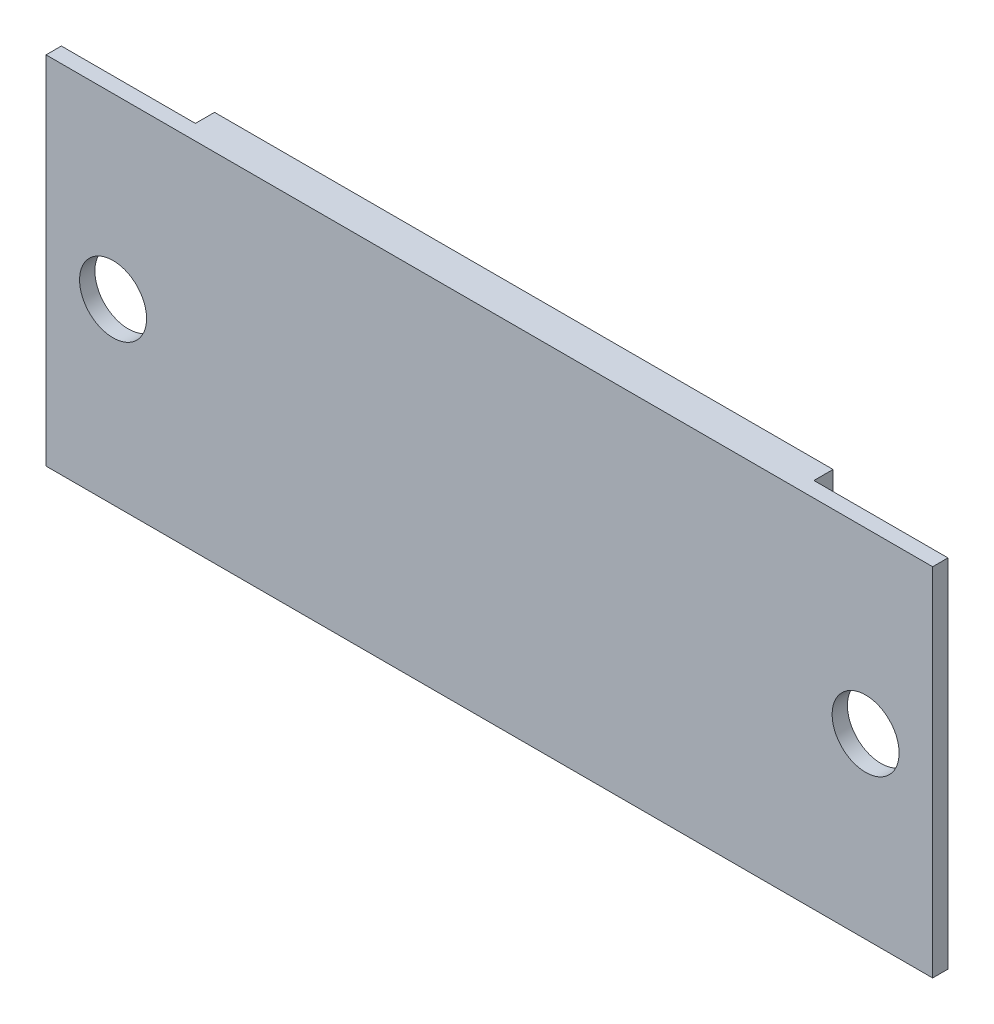
ISO-10303-21;
HEADER;
FILE_DESCRIPTION(('STEP AP214'),'2;1');
FILE_NAME('part.step','',(''),(''),'','','');
FILE_SCHEMA(('AUTOMOTIVE_DESIGN { 1 0 10303 214 1 1 1 1 }'));
ENDSEC;
DATA;
#1=APPLICATION_CONTEXT('core data for automotive mechanical design processes');
#2=APPLICATION_PROTOCOL_DEFINITION('international standard','automotive_design',2000,#1);
#3=PRODUCT_CONTEXT('',#1,'mechanical');
#4=PRODUCT('Part','Part','',(#3));
#5=PRODUCT_RELATED_PRODUCT_CATEGORY('part','',(#4));
#6=PRODUCT_DEFINITION_FORMATION('','',#4);
#7=PRODUCT_DEFINITION_CONTEXT('part definition',#1,'design');
#8=PRODUCT_DEFINITION('design','',#6,#7);
#9=PRODUCT_DEFINITION_SHAPE('','',#8);
#10=(LENGTH_UNIT() NAMED_UNIT(*) SI_UNIT(.MILLI.,.METRE.));
#11=(NAMED_UNIT(*) PLANE_ANGLE_UNIT() SI_UNIT($,.RADIAN.));
#12=(NAMED_UNIT(*) SI_UNIT($,.STERADIAN.) SOLID_ANGLE_UNIT());
#13=UNCERTAINTY_MEASURE_WITH_UNIT(LENGTH_MEASURE(1.E-05),#10,'distance_accuracy_value','');
#14=(GEOMETRIC_REPRESENTATION_CONTEXT(3) GLOBAL_UNCERTAINTY_ASSIGNED_CONTEXT((#13)) GLOBAL_UNIT_ASSIGNED_CONTEXT((#10,
#11,#12)) REPRESENTATION_CONTEXT('',''));
#15=CARTESIAN_POINT('',(0.,0.,0.));
#16=DIRECTION('',(0.,0.,1.));
#17=DIRECTION('',(1.,0.,0.));
#18=AXIS2_PLACEMENT_3D('',#15,#16,#17);
#19=CARTESIAN_POINT('',(16.15,-9.3,1.8));
#20=DIRECTION('',(-1.,0.,0.));
#21=DIRECTION('',(0.,0.,1.));
#22=AXIS2_PLACEMENT_3D('',#19,#20,#21);
#23=PLANE('',#22);
#24=DIRECTION('',(0.,0.,-1.));
#25=VECTOR('',#24,1.);
#26=CARTESIAN_POINT('',(16.15,9.3,1.8));
#27=LINE('',#26,#25);
#28=CARTESIAN_POINT('',(16.15,9.3,1.));
#29=VERTEX_POINT('',#28);
#30=CARTESIAN_POINT('',(16.15,9.3,0.));
#31=VERTEX_POINT('',#30);
#32=EDGE_CURVE('E12',#29,#31,#27,.T.);
#33=ORIENTED_EDGE('',*,*,#32,.F.);
#34=DIRECTION('',(0.,-1.,0.));
#35=VECTOR('',#34,1.);
#36=CARTESIAN_POINT('',(16.15,9.3,1.));
#37=LINE('',#36,#35);
#38=CARTESIAN_POINT('',(16.15,-9.3,1.));
#39=VERTEX_POINT('',#38);
#40=EDGE_CURVE('E99',#29,#39,#37,.T.);
#41=ORIENTED_EDGE('',*,*,#40,.T.);
#42=DIRECTION('',(0.,0.,-1.));
#43=VECTOR('',#42,1.);
#44=CARTESIAN_POINT('',(16.15,-9.3,1.8));
#45=LINE('',#44,#43);
#46=CARTESIAN_POINT('',(16.15,-9.3,0.));
#47=VERTEX_POINT('',#46);
#48=EDGE_CURVE('E120',#39,#47,#45,.T.);
#49=ORIENTED_EDGE('',*,*,#48,.T.);
#50=DIRECTION('',(0.,1.,0.));
#51=VECTOR('',#50,1.);
#52=CARTESIAN_POINT('',(16.15,-9.3,0.));
#53=LINE('',#52,#51);
#54=EDGE_CURVE('E119',#47,#31,#53,.T.);
#55=ORIENTED_EDGE('',*,*,#54,.T.);
#56=EDGE_LOOP('',(#33,#41,#49,#55));
#57=FACE_BOUND('',#56,.T.);
#58=ADVANCED_FACE('F39',(#57),#23,.F.);
#59=CARTESIAN_POINT('',(-16.15,9.3,1.8));
#60=DIRECTION('',(0.,-1.,0.));
#61=DIRECTION('',(0.,0.,-1.));
#62=AXIS2_PLACEMENT_3D('',#59,#60,#61);
#63=PLANE('',#62);
#64=DIRECTION('',(-1.,0.,0.));
#65=VECTOR('',#64,1.);
#66=CARTESIAN_POINT('',(-16.15,9.3,0.));
#67=LINE('',#66,#65);
#68=CARTESIAN_POINT('',(-16.15,9.3,0.));
#69=VERTEX_POINT('',#68);
#70=EDGE_CURVE('E124',#31,#69,#67,.T.);
#71=ORIENTED_EDGE('',*,*,#70,.T.);
#72=DIRECTION('',(0.,0.,-1.));
#73=VECTOR('',#72,1.);
#74=CARTESIAN_POINT('',(-16.15,9.3,1.8));
#75=LINE('',#74,#73);
#76=CARTESIAN_POINT('',(-16.15,9.3,1.));
#77=VERTEX_POINT('',#76);
#78=EDGE_CURVE('E46',#77,#69,#75,.T.);
#79=ORIENTED_EDGE('',*,*,#78,.F.);
#80=DIRECTION('',(-1.,0.,0.));
#81=VECTOR('',#80,1.);
#82=CARTESIAN_POINT('',(-16.15,9.3,1.));
#83=LINE('',#82,#81);
#84=CARTESIAN_POINT('',(-23.15,9.3,1.));
#85=VERTEX_POINT('',#84);
#86=EDGE_CURVE('E61',#77,#85,#83,.T.);
#87=ORIENTED_EDGE('',*,*,#86,.T.);
#88=DIRECTION('',(0.,0.,1.));
#89=VECTOR('',#88,1.);
#90=CARTESIAN_POINT('',(-23.15,9.3,-19.8736005796635));
#91=LINE('',#90,#89);
#92=CARTESIAN_POINT('',(-23.15,9.3,1.8));
#93=VERTEX_POINT('',#92);
#94=EDGE_CURVE('E125',#85,#93,#91,.T.);
#95=ORIENTED_EDGE('',*,*,#94,.T.);
#96=DIRECTION('',(-1.,0.,0.));
#97=VECTOR('',#96,1.);
#98=CARTESIAN_POINT('',(-16.15,9.3,1.8));
#99=LINE('',#98,#97);
#100=CARTESIAN_POINT('',(23.15,9.3,1.8));
#101=VERTEX_POINT('',#100);
#102=EDGE_CURVE('E139',#101,#93,#99,.T.);
#103=ORIENTED_EDGE('',*,*,#102,.F.);
#104=DIRECTION('',(0.,0.,1.));
#105=VECTOR('',#104,1.);
#106=CARTESIAN_POINT('',(23.15,9.3,-19.8736005796635));
#107=LINE('',#106,#105);
#108=CARTESIAN_POINT('',(23.15,9.3,1.));
#109=VERTEX_POINT('',#108);
#110=EDGE_CURVE('E114',#109,#101,#107,.T.);
#111=ORIENTED_EDGE('',*,*,#110,.F.);
#112=DIRECTION('',(-1.,0.,0.));
#113=VECTOR('',#112,1.);
#114=CARTESIAN_POINT('',(16.15,9.3,1.));
#115=LINE('',#114,#113);
#116=EDGE_CURVE('E102',#109,#29,#115,.T.);
#117=ORIENTED_EDGE('',*,*,#116,.T.);
#118=ORIENTED_EDGE('',*,*,#32,.T.);
#119=EDGE_LOOP('',(#71,#79,#87,#95,#103,#111,#117,#118));
#120=FACE_BOUND('',#119,.T.);
#121=ADVANCED_FACE('F111',(#120),#63,.F.);
#122=CARTESIAN_POINT('',(-16.15,-9.3,1.8));
#123=DIRECTION('',(1.,0.,0.));
#124=DIRECTION('',(0.,0.,-1.));
#125=AXIS2_PLACEMENT_3D('',#122,#123,#124);
#126=PLANE('',#125);
#127=DIRECTION('',(0.,0.,-1.));
#128=VECTOR('',#127,1.);
#129=CARTESIAN_POINT('',(-16.15,-9.3,1.8));
#130=LINE('',#129,#128);
#131=CARTESIAN_POINT('',(-16.15,-9.3,1.));
#132=VERTEX_POINT('',#131);
#133=CARTESIAN_POINT('',(-16.15,-9.3,0.));
#134=VERTEX_POINT('',#133);
#135=EDGE_CURVE('E141',#132,#134,#130,.T.);
#136=ORIENTED_EDGE('',*,*,#135,.F.);
#137=DIRECTION('',(0.,1.,0.));
#138=VECTOR('',#137,1.);
#139=CARTESIAN_POINT('',(-16.15,9.3,1.));
#140=LINE('',#139,#138);
#141=EDGE_CURVE('E147',#132,#77,#140,.T.);
#142=ORIENTED_EDGE('',*,*,#141,.T.);
#143=ORIENTED_EDGE('',*,*,#78,.T.);
#144=DIRECTION('',(0.,-1.,0.));
#145=VECTOR('',#144,1.);
#146=CARTESIAN_POINT('',(-16.15,-9.3,0.));
#147=LINE('',#146,#145);
#148=EDGE_CURVE('E127',#69,#134,#147,.T.);
#149=ORIENTED_EDGE('',*,*,#148,.T.);
#150=EDGE_LOOP('',(#136,#142,#143,#149));
#151=FACE_BOUND('',#150,.T.);
#152=ADVANCED_FACE('F145',(#151),#126,.F.);
#153=CARTESIAN_POINT('',(-16.15,-9.3,1.8));
#154=DIRECTION('',(0.,1.,0.));
#155=DIRECTION('',(0.,0.,1.));
#156=AXIS2_PLACEMENT_3D('',#153,#154,#155);
#157=PLANE('',#156);
#158=DIRECTION('',(1.,0.,0.));
#159=VECTOR('',#158,1.);
#160=CARTESIAN_POINT('',(-16.15,-9.3,0.));
#161=LINE('',#160,#159);
#162=EDGE_CURVE('E137',#134,#47,#161,.T.);
#163=ORIENTED_EDGE('',*,*,#162,.T.);
#164=ORIENTED_EDGE('',*,*,#48,.F.);
#165=DIRECTION('',(1.,0.,0.));
#166=VECTOR('',#165,1.);
#167=CARTESIAN_POINT('',(23.15,-9.3,1.));
#168=LINE('',#167,#166);
#169=CARTESIAN_POINT('',(23.15,-9.3,1.));
#170=VERTEX_POINT('',#169);
#171=EDGE_CURVE('E53',#39,#170,#168,.T.);
#172=ORIENTED_EDGE('',*,*,#171,.T.);
#173=DIRECTION('',(0.,0.,1.));
#174=VECTOR('',#173,1.);
#175=CARTESIAN_POINT('',(23.15,-9.3,-19.8736005796635));
#176=LINE('',#175,#174);
#177=CARTESIAN_POINT('',(23.15,-9.3,1.8));
#178=VERTEX_POINT('',#177);
#179=EDGE_CURVE('E171',#170,#178,#176,.T.);
#180=ORIENTED_EDGE('',*,*,#179,.T.);
#181=DIRECTION('',(1.,0.,0.));
#182=VECTOR('',#181,1.);
#183=CARTESIAN_POINT('',(-16.15,-9.3,1.8));
#184=LINE('',#183,#182);
#185=CARTESIAN_POINT('',(-23.15,-9.3,1.8));
#186=VERTEX_POINT('',#185);
#187=EDGE_CURVE('E132',#186,#178,#184,.T.);
#188=ORIENTED_EDGE('',*,*,#187,.F.);
#189=DIRECTION('',(0.,0.,1.));
#190=VECTOR('',#189,1.);
#191=CARTESIAN_POINT('',(-23.15,-9.3,-19.8736005796635));
#192=LINE('',#191,#190);
#193=CARTESIAN_POINT('',(-23.15,-9.3,1.));
#194=VERTEX_POINT('',#193);
#195=EDGE_CURVE('E155',#194,#186,#192,.T.);
#196=ORIENTED_EDGE('',*,*,#195,.F.);
#197=DIRECTION('',(1.,0.,0.));
#198=VECTOR('',#197,1.);
#199=CARTESIAN_POINT('',(-23.15,-9.3,1.));
#200=LINE('',#199,#198);
#201=EDGE_CURVE('E153',#194,#132,#200,.T.);
#202=ORIENTED_EDGE('',*,*,#201,.T.);
#203=ORIENTED_EDGE('',*,*,#135,.T.);
#204=EDGE_LOOP('',(#163,#164,#172,#180,#188,#196,#202,#203));
#205=FACE_BOUND('',#204,.T.);
#206=ADVANCED_FACE('F150',(#205),#157,.F.);
#207=CARTESIAN_POINT('',(0.,0.,1.8));
#208=DIRECTION('',(0.,0.,-1.));
#209=DIRECTION('',(-1.,0.,0.));
#210=AXIS2_PLACEMENT_3D('',#207,#208,#209);
#211=PLANE('',#210);
#212=CARTESIAN_POINT('',(-19.65,0.,1.8));
#213=DIRECTION('',(0.,0.,1.));
#214=DIRECTION('',(1.,0.,0.));
#215=AXIS2_PLACEMENT_3D('',#212,#213,#214);
#216=CIRCLE('',#215,1.75);
#217=CARTESIAN_POINT('',(-17.9,0.,1.8));
#218=VERTEX_POINT('',#217);
#219=EDGE_CURVE('E179',#218,#218,#216,.T.);
#220=ORIENTED_EDGE('',*,*,#219,.F.);
#221=EDGE_LOOP('',(#220));
#222=FACE_BOUND('',#221,.T.);
#223=CARTESIAN_POINT('',(19.65,0.,1.8));
#224=DIRECTION('',(0.,0.,1.));
#225=DIRECTION('',(-1.,0.,0.));
#226=AXIS2_PLACEMENT_3D('',#223,#224,#225);
#227=CIRCLE('',#226,1.75);
#228=CARTESIAN_POINT('',(17.9,0.,1.8));
#229=VERTEX_POINT('',#228);
#230=EDGE_CURVE('E222',#229,#229,#227,.T.);
#231=ORIENTED_EDGE('',*,*,#230,.F.);
#232=EDGE_LOOP('',(#231));
#233=FACE_BOUND('',#232,.T.);
#234=ORIENTED_EDGE('',*,*,#187,.T.);
#235=DIRECTION('',(0.,1.,0.));
#236=VECTOR('',#235,1.);
#237=CARTESIAN_POINT('',(23.15,9.3,1.8));
#238=LINE('',#237,#236);
#239=EDGE_CURVE('E115',#178,#101,#238,.T.);
#240=ORIENTED_EDGE('',*,*,#239,.T.);
#241=ORIENTED_EDGE('',*,*,#102,.T.);
#242=DIRECTION('',(0.,-1.,0.));
#243=VECTOR('',#242,1.);
#244=CARTESIAN_POINT('',(-23.15,9.3,1.8));
#245=LINE('',#244,#243);
#246=EDGE_CURVE('E169',#93,#186,#245,.T.);
#247=ORIENTED_EDGE('',*,*,#246,.T.);
#248=EDGE_LOOP('',(#234,#240,#241,#247));
#249=FACE_BOUND('',#248,.T.);
#250=ADVANCED_FACE('F166',(#222,#233,#249),#211,.F.);
#251=CARTESIAN_POINT('',(0.,0.,0.));
#252=DIRECTION('',(0.,0.,-1.));
#253=DIRECTION('',(-1.,0.,0.));
#254=AXIS2_PLACEMENT_3D('',#251,#252,#253);
#255=PLANE('',#254);
#256=ORIENTED_EDGE('',*,*,#54,.F.);
#257=ORIENTED_EDGE('',*,*,#162,.F.);
#258=ORIENTED_EDGE('',*,*,#148,.F.);
#259=ORIENTED_EDGE('',*,*,#70,.F.);
#260=EDGE_LOOP('',(#256,#257,#258,#259));
#261=FACE_BOUND('',#260,.T.);
#262=ADVANCED_FACE('F148',(#261),#255,.T.);
#263=CARTESIAN_POINT('',(0.,0.,1.));
#264=DIRECTION('',(0.,0.,-1.));
#265=DIRECTION('',(-1.,0.,0.));
#266=AXIS2_PLACEMENT_3D('',#263,#264,#265);
#267=PLANE('',#266);
#268=CARTESIAN_POINT('',(-19.65,0.,1.));
#269=DIRECTION('',(0.,0.,-1.));
#270=DIRECTION('',(-1.,0.,0.));
#271=AXIS2_PLACEMENT_3D('',#268,#269,#270);
#272=CIRCLE('',#271,1.75);
#273=CARTESIAN_POINT('',(-21.4,0.,1.));
#274=VERTEX_POINT('',#273);
#275=EDGE_CURVE('E176',#274,#274,#272,.F.);
#276=ORIENTED_EDGE('',*,*,#275,.T.);
#277=EDGE_LOOP('',(#276));
#278=FACE_BOUND('',#277,.T.);
#279=ORIENTED_EDGE('',*,*,#86,.F.);
#280=ORIENTED_EDGE('',*,*,#141,.F.);
#281=ORIENTED_EDGE('',*,*,#201,.F.);
#282=DIRECTION('',(0.,-1.,0.));
#283=VECTOR('',#282,1.);
#284=CARTESIAN_POINT('',(-23.15,9.3,1.));
#285=LINE('',#284,#283);
#286=EDGE_CURVE('E159',#85,#194,#285,.T.);
#287=ORIENTED_EDGE('',*,*,#286,.F.);
#288=EDGE_LOOP('',(#279,#280,#281,#287));
#289=FACE_BOUND('',#288,.T.);
#290=ADVANCED_FACE('F192',(#278,#289),#267,.T.);
#291=CARTESIAN_POINT('',(-23.15,9.3,-19.8736005796635));
#292=DIRECTION('',(-1.,0.,0.));
#293=DIRECTION('',(0.,-1.,0.));
#294=AXIS2_PLACEMENT_3D('',#291,#292,#293);
#295=PLANE('',#294);
#296=ORIENTED_EDGE('',*,*,#94,.F.);
#297=ORIENTED_EDGE('',*,*,#286,.T.);
#298=ORIENTED_EDGE('',*,*,#195,.T.);
#299=ORIENTED_EDGE('',*,*,#246,.F.);
#300=EDGE_LOOP('',(#296,#297,#298,#299));
#301=FACE_BOUND('',#300,.T.);
#302=ADVANCED_FACE('F191',(#301),#295,.T.);
#303=CARTESIAN_POINT('',(0.,0.,1.));
#304=DIRECTION('',(0.,0.,-1.));
#305=DIRECTION('',(-1.,0.,0.));
#306=AXIS2_PLACEMENT_3D('',#303,#304,#305);
#307=PLANE('',#306);
#308=CARTESIAN_POINT('',(19.65,0.,1.));
#309=DIRECTION('',(0.,0.,-1.));
#310=DIRECTION('',(-1.,0.,0.));
#311=AXIS2_PLACEMENT_3D('',#308,#309,#310);
#312=CIRCLE('',#311,1.75);
#313=CARTESIAN_POINT('',(17.9,0.,1.));
#314=VERTEX_POINT('',#313);
#315=EDGE_CURVE('E182',#314,#314,#312,.F.);
#316=ORIENTED_EDGE('',*,*,#315,.T.);
#317=EDGE_LOOP('',(#316));
#318=FACE_BOUND('',#317,.T.);
#319=DIRECTION('',(0.,1.,0.));
#320=VECTOR('',#319,1.);
#321=CARTESIAN_POINT('',(23.15,9.3,1.));
#322=LINE('',#321,#320);
#323=EDGE_CURVE('E173',#170,#109,#322,.T.);
#324=ORIENTED_EDGE('',*,*,#323,.F.);
#325=ORIENTED_EDGE('',*,*,#171,.F.);
#326=ORIENTED_EDGE('',*,*,#40,.F.);
#327=ORIENTED_EDGE('',*,*,#116,.F.);
#328=EDGE_LOOP('',(#324,#325,#326,#327));
#329=FACE_BOUND('',#328,.T.);
#330=ADVANCED_FACE('F101',(#318,#329),#307,.T.);
#331=CARTESIAN_POINT('',(23.15,9.3,-19.8736005796635));
#332=DIRECTION('',(1.,0.,0.));
#333=DIRECTION('',(0.,1.,0.));
#334=AXIS2_PLACEMENT_3D('',#331,#332,#333);
#335=PLANE('',#334);
#336=ORIENTED_EDGE('',*,*,#179,.F.);
#337=ORIENTED_EDGE('',*,*,#323,.T.);
#338=ORIENTED_EDGE('',*,*,#110,.T.);
#339=ORIENTED_EDGE('',*,*,#239,.F.);
#340=EDGE_LOOP('',(#336,#337,#338,#339));
#341=FACE_BOUND('',#340,.T.);
#342=ADVANCED_FACE('F175',(#341),#335,.T.);
#343=CARTESIAN_POINT('',(19.65,0.,-3.94974746830583));
#344=DIRECTION('',(0.,0.,1.));
#345=DIRECTION('',(1.,0.,0.));
#346=AXIS2_PLACEMENT_3D('',#343,#344,#345);
#347=CYLINDRICAL_SURFACE('',#346,1.75);
#348=ORIENTED_EDGE('',*,*,#230,.T.);
#349=EDGE_LOOP('',(#348));
#350=FACE_BOUND('',#349,.T.);
#351=ORIENTED_EDGE('',*,*,#315,.F.);
#352=EDGE_LOOP('',(#351));
#353=FACE_BOUND('',#352,.T.);
#354=ADVANCED_FACE('F230',(#350,#353),#347,.F.);
#355=CARTESIAN_POINT('',(-19.65,0.,-3.94974746830583));
#356=DIRECTION('',(0.,0.,1.));
#357=DIRECTION('',(1.,0.,0.));
#358=AXIS2_PLACEMENT_3D('',#355,#356,#357);
#359=CYLINDRICAL_SURFACE('',#358,1.75);
#360=ORIENTED_EDGE('',*,*,#219,.T.);
#361=EDGE_LOOP('',(#360));
#362=FACE_BOUND('',#361,.T.);
#363=ORIENTED_EDGE('',*,*,#275,.F.);
#364=EDGE_LOOP('',(#363));
#365=FACE_BOUND('',#364,.T.);
#366=ADVANCED_FACE('F227',(#362,#365),#359,.F.);
#367=CLOSED_SHELL('',(#58,#121,#152,#206,#250,#262,#290,#302,#330,#342,#354,#366));
#368=MANIFOLD_SOLID_BREP('B2',#367);
#369=ADVANCED_BREP_SHAPE_REPRESENTATION('',(#18,#368),#14);
#370=SHAPE_DEFINITION_REPRESENTATION(#9,#369);
ENDSEC;
END-ISO-10303-21;
